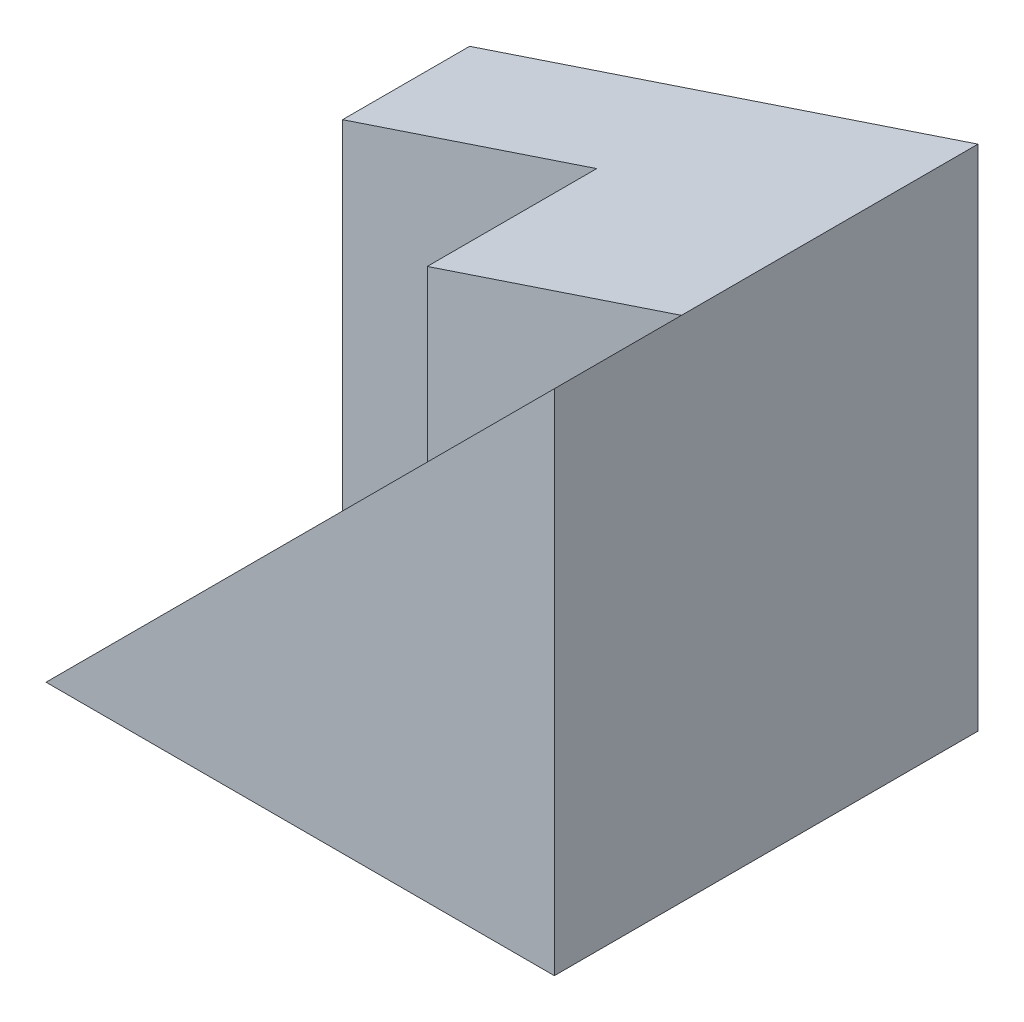
ISO-10303-21;
HEADER;
FILE_DESCRIPTION(('STEP AP214'),'2;1');
FILE_NAME('part.step','',(''),(''),'','','');
FILE_SCHEMA(('AUTOMOTIVE_DESIGN { 1 0 10303 214 1 1 1 1 }'));
ENDSEC;
DATA;
#1=APPLICATION_CONTEXT('core data for automotive mechanical design processes');
#2=APPLICATION_PROTOCOL_DEFINITION('international standard','automotive_design',2000,#1);
#3=PRODUCT_CONTEXT('',#1,'mechanical');
#4=PRODUCT('Part','Part','',(#3));
#5=PRODUCT_RELATED_PRODUCT_CATEGORY('part','',(#4));
#6=PRODUCT_DEFINITION_FORMATION('','',#4);
#7=PRODUCT_DEFINITION_CONTEXT('part definition',#1,'design');
#8=PRODUCT_DEFINITION('design','',#6,#7);
#9=PRODUCT_DEFINITION_SHAPE('','',#8);
#10=(LENGTH_UNIT() NAMED_UNIT(*) SI_UNIT(.MILLI.,.METRE.));
#11=(NAMED_UNIT(*) PLANE_ANGLE_UNIT() SI_UNIT($,.RADIAN.));
#12=(NAMED_UNIT(*) SI_UNIT($,.STERADIAN.) SOLID_ANGLE_UNIT());
#13=UNCERTAINTY_MEASURE_WITH_UNIT(LENGTH_MEASURE(1.E-05),#10,'distance_accuracy_value','');
#14=(GEOMETRIC_REPRESENTATION_CONTEXT(3) GLOBAL_UNCERTAINTY_ASSIGNED_CONTEXT((#13)) GLOBAL_UNIT_ASSIGNED_CONTEXT((#10,
#11,#12)) REPRESENTATION_CONTEXT('',''));
#15=CARTESIAN_POINT('',(0.,0.,0.));
#16=DIRECTION('',(0.,0.,1.));
#17=DIRECTION('',(1.,0.,0.));
#18=AXIS2_PLACEMENT_3D('',#15,#16,#17);
#19=CARTESIAN_POINT('',(-3.,6.,2.5));
#20=DIRECTION('',(1.,0.,0.));
#21=DIRECTION('',(0.,0.,-1.));
#22=AXIS2_PLACEMENT_3D('',#19,#20,#21);
#23=PLANE('',#22);
#24=DIRECTION('',(0.,-1.,0.));
#25=VECTOR('',#24,1.);
#26=CARTESIAN_POINT('',(-3.,0.,-1.));
#27=LINE('',#26,#25);
#28=CARTESIAN_POINT('',(-3.,4.,-1.));
#29=VERTEX_POINT('',#28);
#30=CARTESIAN_POINT('',(-3.,0.,-1.));
#31=VERTEX_POINT('',#30);
#32=EDGE_CURVE('E108',#29,#31,#27,.T.);
#33=ORIENTED_EDGE('',*,*,#32,.F.);
#34=DIRECTION('',(0.,0.,1.));
#35=VECTOR('',#34,1.);
#36=CARTESIAN_POINT('',(-3.,4.,-2.5));
#37=LINE('',#36,#35);
#38=CARTESIAN_POINT('',(-3.,4.,-2.5));
#39=VERTEX_POINT('',#38);
#40=EDGE_CURVE('E94',#39,#29,#37,.T.);
#41=ORIENTED_EDGE('',*,*,#40,.F.);
#42=DIRECTION('',(0.,-1.,0.));
#43=VECTOR('',#42,1.);
#44=CARTESIAN_POINT('',(-3.,6.,-2.5));
#45=LINE('',#44,#43);
#46=CARTESIAN_POINT('',(-3.,0.,-2.5));
#47=VERTEX_POINT('',#46);
#48=EDGE_CURVE('E106',#39,#47,#45,.T.);
#49=ORIENTED_EDGE('',*,*,#48,.T.);
#50=DIRECTION('',(0.,0.,1.));
#51=VECTOR('',#50,1.);
#52=CARTESIAN_POINT('',(-3.,0.,2.5));
#53=LINE('',#52,#51);
#54=EDGE_CURVE('E123',#47,#31,#53,.T.);
#55=ORIENTED_EDGE('',*,*,#54,.T.);
#56=EDGE_LOOP('',(#33,#41,#49,#55));
#57=FACE_BOUND('',#56,.T.);
#58=ADVANCED_FACE('F35',(#57),#23,.F.);
#59=CARTESIAN_POINT('',(3.,6.,2.5));
#60=DIRECTION('',(-1.,0.,0.));
#61=DIRECTION('',(0.,0.,1.));
#62=AXIS2_PLACEMENT_3D('',#59,#60,#61);
#63=PLANE('',#62);
#64=DIRECTION('',(0.,0.,-1.));
#65=VECTOR('',#64,1.);
#66=CARTESIAN_POINT('',(3.,6.,2.5));
#67=LINE('',#66,#65);
#68=CARTESIAN_POINT('',(3.,6.,1.));
#69=VERTEX_POINT('',#68);
#70=CARTESIAN_POINT('',(3.,6.,-2.5));
#71=VERTEX_POINT('',#70);
#72=EDGE_CURVE('E96',#69,#71,#67,.T.);
#73=ORIENTED_EDGE('',*,*,#72,.F.);
#74=CARTESIAN_POINT('',(3.,6.,2.5));
#75=VERTEX_POINT('',#74);
#76=EDGE_CURVE('E118',#75,#69,#67,.T.);
#77=ORIENTED_EDGE('',*,*,#76,.F.);
#78=DIRECTION('',(0.,-1.,0.));
#79=VECTOR('',#78,1.);
#80=CARTESIAN_POINT('',(3.,6.,2.5));
#81=LINE('',#80,#79);
#82=CARTESIAN_POINT('',(3.,0.,2.5));
#83=VERTEX_POINT('',#82);
#84=EDGE_CURVE('E114',#75,#83,#81,.T.);
#85=ORIENTED_EDGE('',*,*,#84,.T.);
#86=DIRECTION('',(0.,0.,-1.));
#87=VECTOR('',#86,1.);
#88=CARTESIAN_POINT('',(3.,0.,2.5));
#89=LINE('',#88,#87);
#90=CARTESIAN_POINT('',(3.,0.,-2.5));
#91=VERTEX_POINT('',#90);
#92=EDGE_CURVE('E126',#83,#91,#89,.T.);
#93=ORIENTED_EDGE('',*,*,#92,.T.);
#94=DIRECTION('',(0.,-1.,0.));
#95=VECTOR('',#94,1.);
#96=CARTESIAN_POINT('',(3.,6.,-2.5));
#97=LINE('',#96,#95);
#98=EDGE_CURVE('E113',#71,#91,#97,.T.);
#99=ORIENTED_EDGE('',*,*,#98,.F.);
#100=EDGE_LOOP('',(#73,#77,#85,#93,#99));
#101=FACE_BOUND('',#100,.T.);
#102=ADVANCED_FACE('F37',(#101),#63,.F.);
#103=CARTESIAN_POINT('',(-3.,6.,-2.5));
#104=DIRECTION('',(0.,0.,1.));
#105=DIRECTION('',(1.,0.,0.));
#106=AXIS2_PLACEMENT_3D('',#103,#104,#105);
#107=PLANE('',#106);
#108=ORIENTED_EDGE('',*,*,#48,.F.);
#109=DIRECTION('',(0.948683298050514,0.316227766016838,0.));
#110=VECTOR('',#109,1.);
#111=CARTESIAN_POINT('',(3.,6.,-2.5));
#112=LINE('',#111,#110);
#113=EDGE_CURVE('E91',#39,#71,#112,.T.);
#114=ORIENTED_EDGE('',*,*,#113,.T.);
#115=ORIENTED_EDGE('',*,*,#98,.T.);
#116=DIRECTION('',(-1.,0.,0.));
#117=VECTOR('',#116,1.);
#118=CARTESIAN_POINT('',(-3.,0.,-2.5));
#119=LINE('',#118,#117);
#120=EDGE_CURVE('E111',#91,#47,#119,.T.);
#121=ORIENTED_EDGE('',*,*,#120,.T.);
#122=EDGE_LOOP('',(#108,#114,#115,#121));
#123=FACE_BOUND('',#122,.T.);
#124=ADVANCED_FACE('F110',(#123),#107,.F.);
#125=CARTESIAN_POINT('',(-3.,6.,2.5));
#126=DIRECTION('',(0.,0.,-1.));
#127=DIRECTION('',(-1.,0.,0.));
#128=AXIS2_PLACEMENT_3D('',#125,#126,#127);
#129=PLANE('',#128);
#130=ORIENTED_EDGE('',*,*,#84,.F.);
#131=DIRECTION('',(0.707106781186548,0.707106781186548,0.));
#132=VECTOR('',#131,1.);
#133=CARTESIAN_POINT('',(3.,6.,2.5));
#134=LINE('',#133,#132);
#135=CARTESIAN_POINT('',(-3.,0.,2.5));
#136=VERTEX_POINT('',#135);
#137=EDGE_CURVE('E133',#136,#75,#134,.T.);
#138=ORIENTED_EDGE('',*,*,#137,.F.);
#139=DIRECTION('',(1.,0.,0.));
#140=VECTOR('',#139,1.);
#141=CARTESIAN_POINT('',(-3.,0.,2.5));
#142=LINE('',#141,#140);
#143=EDGE_CURVE('E121',#136,#83,#142,.T.);
#144=ORIENTED_EDGE('',*,*,#143,.T.);
#145=EDGE_LOOP('',(#130,#138,#144));
#146=FACE_BOUND('',#145,.T.);
#147=ADVANCED_FACE('F180',(#146),#129,.F.);
#148=CARTESIAN_POINT('',(0.,0.,0.));
#149=DIRECTION('',(0.,-1.,0.));
#150=DIRECTION('',(0.,0.,-1.));
#151=AXIS2_PLACEMENT_3D('',#148,#149,#150);
#152=PLANE('',#151);
#153=ORIENTED_EDGE('',*,*,#92,.F.);
#154=ORIENTED_EDGE('',*,*,#143,.F.);
#155=DIRECTION('',(0.,0.,1.));
#156=VECTOR('',#155,1.);
#157=CARTESIAN_POINT('',(-3.,0.,-1.));
#158=LINE('',#157,#156);
#159=EDGE_CURVE('E129',#31,#136,#158,.T.);
#160=ORIENTED_EDGE('',*,*,#159,.F.);
#161=ORIENTED_EDGE('',*,*,#54,.F.);
#162=ORIENTED_EDGE('',*,*,#120,.F.);
#163=EDGE_LOOP('',(#153,#154,#160,#161,#162));
#164=FACE_BOUND('',#163,.T.);
#165=ADVANCED_FACE('F170',(#164),#152,.T.);
#166=CARTESIAN_POINT('',(3.,6.,-1.));
#167=DIRECTION('',(0.707106781186547,-0.707106781186547,0.));
#168=DIRECTION('',(0.707106781186548,0.707106781186548,0.));
#169=AXIS2_PLACEMENT_3D('',#166,#167,#168);
#170=PLANE('',#169);
#171=ORIENTED_EDGE('',*,*,#76,.T.);
#172=DIRECTION('',(-0.707106781186548,-0.707106781186548,0.));
#173=VECTOR('',#172,1.);
#174=CARTESIAN_POINT('',(3.,6.,1.));
#175=LINE('',#174,#173);
#176=CARTESIAN_POINT('',(0.,3.,1.));
#177=VERTEX_POINT('',#176);
#178=EDGE_CURVE('E43',#69,#177,#175,.T.);
#179=ORIENTED_EDGE('',*,*,#178,.T.);
#180=DIRECTION('',(0.,0.,1.));
#181=VECTOR('',#180,1.);
#182=CARTESIAN_POINT('',(0.,3.,-1.));
#183=LINE('',#182,#181);
#184=CARTESIAN_POINT('',(0.,3.,-1.));
#185=VERTEX_POINT('',#184);
#186=EDGE_CURVE('E142',#185,#177,#183,.T.);
#187=ORIENTED_EDGE('',*,*,#186,.F.);
#188=DIRECTION('',(0.707106781186548,0.707106781186548,0.));
#189=VECTOR('',#188,1.);
#190=CARTESIAN_POINT('',(3.,6.,-1.));
#191=LINE('',#190,#189);
#192=EDGE_CURVE('E132',#31,#185,#191,.T.);
#193=ORIENTED_EDGE('',*,*,#192,.F.);
#194=ORIENTED_EDGE('',*,*,#159,.T.);
#195=ORIENTED_EDGE('',*,*,#137,.T.);
#196=EDGE_LOOP('',(#171,#179,#187,#193,#194,#195));
#197=FACE_BOUND('',#196,.T.);
#198=ADVANCED_FACE('F152',(#197),#170,.F.);
#199=CARTESIAN_POINT('',(0.,0.,-1.));
#200=DIRECTION('',(0.,0.,1.));
#201=DIRECTION('',(1.,0.,0.));
#202=AXIS2_PLACEMENT_3D('',#199,#200,#201);
#203=PLANE('',#202);
#204=DIRECTION('',(0.948683298050514,0.316227766016838,0.));
#205=VECTOR('',#204,1.);
#206=CARTESIAN_POINT('',(-1.5,4.5,-1.));
#207=LINE('',#206,#205);
#208=CARTESIAN_POINT('',(0.,5.,-1.));
#209=VERTEX_POINT('',#208);
#210=EDGE_CURVE('E49',#29,#209,#207,.T.);
#211=ORIENTED_EDGE('',*,*,#210,.F.);
#212=ORIENTED_EDGE('',*,*,#32,.T.);
#213=ORIENTED_EDGE('',*,*,#192,.T.);
#214=DIRECTION('',(0.,1.,0.));
#215=VECTOR('',#214,1.);
#216=CARTESIAN_POINT('',(0.,3.,-1.));
#217=LINE('',#216,#215);
#218=EDGE_CURVE('E135',#185,#209,#217,.T.);
#219=ORIENTED_EDGE('',*,*,#218,.T.);
#220=EDGE_LOOP('',(#211,#212,#213,#219));
#221=FACE_BOUND('',#220,.T.);
#222=ADVANCED_FACE('F162',(#221),#203,.T.);
#223=CARTESIAN_POINT('',(0.,3.,1.));
#224=DIRECTION('',(0.,0.,1.));
#225=DIRECTION('',(1.,0.,0.));
#226=AXIS2_PLACEMENT_3D('',#223,#224,#225);
#227=PLANE('',#226);
#228=DIRECTION('',(0.948683298050514,0.316227766016838,0.));
#229=VECTOR('',#228,1.);
#230=CARTESIAN_POINT('',(3.,6.,1.));
#231=LINE('',#230,#229);
#232=CARTESIAN_POINT('',(0.,5.,1.));
#233=VERTEX_POINT('',#232);
#234=EDGE_CURVE('E101',#233,#69,#231,.T.);
#235=ORIENTED_EDGE('',*,*,#234,.F.);
#236=DIRECTION('',(0.,1.,0.));
#237=VECTOR('',#236,1.);
#238=CARTESIAN_POINT('',(0.,3.,1.));
#239=LINE('',#238,#237);
#240=EDGE_CURVE('E139',#177,#233,#239,.T.);
#241=ORIENTED_EDGE('',*,*,#240,.F.);
#242=ORIENTED_EDGE('',*,*,#178,.F.);
#243=EDGE_LOOP('',(#235,#241,#242));
#244=FACE_BOUND('',#243,.T.);
#245=ADVANCED_FACE('F155',(#244),#227,.T.);
#246=CARTESIAN_POINT('',(0.,3.,-1.));
#247=DIRECTION('',(-1.,0.,0.));
#248=DIRECTION('',(0.,0.,1.));
#249=AXIS2_PLACEMENT_3D('',#246,#247,#248);
#250=PLANE('',#249);
#251=DIRECTION('',(0.,0.,1.));
#252=VECTOR('',#251,1.);
#253=CARTESIAN_POINT('',(0.,5.,-1.));
#254=LINE('',#253,#252);
#255=EDGE_CURVE('E11',#209,#233,#254,.T.);
#256=ORIENTED_EDGE('',*,*,#255,.F.);
#257=ORIENTED_EDGE('',*,*,#218,.F.);
#258=ORIENTED_EDGE('',*,*,#186,.T.);
#259=ORIENTED_EDGE('',*,*,#240,.T.);
#260=EDGE_LOOP('',(#256,#257,#258,#259));
#261=FACE_BOUND('',#260,.T.);
#262=ADVANCED_FACE('F158',(#261),#250,.T.);
#263=CARTESIAN_POINT('',(3.,6.,-2.5));
#264=DIRECTION('',(0.316227766016838,-0.948683298050514,0.));
#265=DIRECTION('',(0.948683298050514,0.316227766016838,0.));
#266=AXIS2_PLACEMENT_3D('',#263,#264,#265);
#267=PLANE('',#266);
#268=ORIENTED_EDGE('',*,*,#210,.T.);
#269=ORIENTED_EDGE('',*,*,#255,.T.);
#270=ORIENTED_EDGE('',*,*,#234,.T.);
#271=ORIENTED_EDGE('',*,*,#72,.T.);
#272=ORIENTED_EDGE('',*,*,#113,.F.);
#273=ORIENTED_EDGE('',*,*,#40,.T.);
#274=EDGE_LOOP('',(#268,#269,#270,#271,#272,#273));
#275=FACE_BOUND('',#274,.T.);
#276=ADVANCED_FACE('F93',(#275),#267,.F.);
#277=CLOSED_SHELL('',(#58,#102,#124,#147,#165,#198,#222,#245,#262,#276));
#278=MANIFOLD_SOLID_BREP('B2',#277);
#279=ADVANCED_BREP_SHAPE_REPRESENTATION('',(#18,#278),#14);
#280=SHAPE_DEFINITION_REPRESENTATION(#9,#279);
ENDSEC;
END-ISO-10303-21;
